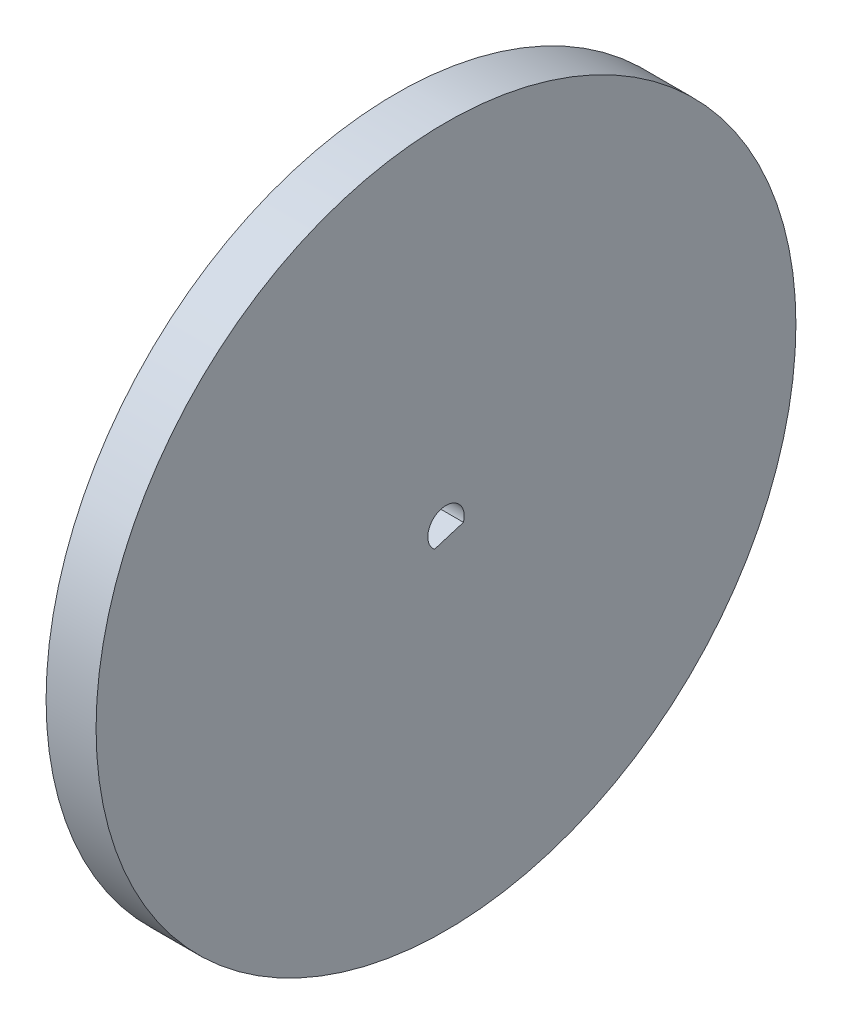
ISO-10303-21;
HEADER;
FILE_DESCRIPTION(('STEP AP214'),'2;1');
FILE_NAME('part.step','',(''),(''),'','','');
FILE_SCHEMA(('AUTOMOTIVE_DESIGN { 1 0 10303 214 1 1 1 1 }'));
ENDSEC;
DATA;
#1=APPLICATION_CONTEXT('core data for automotive mechanical design processes');
#2=APPLICATION_PROTOCOL_DEFINITION('international standard','automotive_design',2000,#1);
#3=PRODUCT_CONTEXT('',#1,'mechanical');
#4=PRODUCT('Part','Part','',(#3));
#5=PRODUCT_RELATED_PRODUCT_CATEGORY('part','',(#4));
#6=PRODUCT_DEFINITION_FORMATION('','',#4);
#7=PRODUCT_DEFINITION_CONTEXT('part definition',#1,'design');
#8=PRODUCT_DEFINITION('design','',#6,#7);
#9=PRODUCT_DEFINITION_SHAPE('','',#8);
#10=(LENGTH_UNIT() NAMED_UNIT(*) SI_UNIT(.MILLI.,.METRE.));
#11=(NAMED_UNIT(*) PLANE_ANGLE_UNIT() SI_UNIT($,.RADIAN.));
#12=(NAMED_UNIT(*) SI_UNIT($,.STERADIAN.) SOLID_ANGLE_UNIT());
#13=UNCERTAINTY_MEASURE_WITH_UNIT(LENGTH_MEASURE(1.E-05),#10,'distance_accuracy_value','');
#14=(GEOMETRIC_REPRESENTATION_CONTEXT(3) GLOBAL_UNCERTAINTY_ASSIGNED_CONTEXT((#13)) GLOBAL_UNIT_ASSIGNED_CONTEXT((#10,
#11,#12)) REPRESENTATION_CONTEXT('',''));
#15=CARTESIAN_POINT('',(0.,0.,0.));
#16=DIRECTION('',(0.,0.,1.));
#17=DIRECTION('',(1.,0.,0.));
#18=AXIS2_PLACEMENT_3D('',#15,#16,#17);
#19=CARTESIAN_POINT('',(6.35,0.,0.));
#20=DIRECTION('',(-1.,0.,0.));
#21=DIRECTION('',(0.,0.,1.));
#22=AXIS2_PLACEMENT_3D('',#19,#20,#21);
#23=CYLINDRICAL_SURFACE('',#22,44.45);
#24=CARTESIAN_POINT('',(6.35,0.,0.));
#25=DIRECTION('',(1.,0.,0.));
#26=DIRECTION('',(0.,0.,-1.));
#27=AXIS2_PLACEMENT_3D('',#24,#25,#26);
#28=CIRCLE('',#27,44.45);
#29=CARTESIAN_POINT('',(6.35,0.,-44.45));
#30=VERTEX_POINT('',#29);
#31=EDGE_CURVE('E11',#30,#30,#28,.T.);
#32=ORIENTED_EDGE('',*,*,#31,.F.);
#33=EDGE_LOOP('',(#32));
#34=FACE_BOUND('',#33,.T.);
#35=CARTESIAN_POINT('',(0.,0.,0.));
#36=DIRECTION('',(1.,0.,0.));
#37=DIRECTION('',(0.,0.,-1.));
#38=AXIS2_PLACEMENT_3D('',#35,#36,#37);
#39=CIRCLE('',#38,44.45);
#40=CARTESIAN_POINT('',(0.,0.,-44.45));
#41=VERTEX_POINT('',#40);
#42=EDGE_CURVE('E40',#41,#41,#39,.T.);
#43=ORIENTED_EDGE('',*,*,#42,.T.);
#44=EDGE_LOOP('',(#43));
#45=FACE_BOUND('',#44,.T.);
#46=ADVANCED_FACE('F37',(#34,#45),#23,.T.);
#47=CARTESIAN_POINT('',(6.35,0.,0.));
#48=DIRECTION('',(1.,0.,0.));
#49=DIRECTION('',(0.,0.,-1.));
#50=AXIS2_PLACEMENT_3D('',#47,#48,#49);
#51=PLANE('',#50);
#52=CARTESIAN_POINT('',(6.35,0.,0.));
#53=DIRECTION('',(1.,0.,0.));
#54=DIRECTION('',(0.,0.,-1.));
#55=AXIS2_PLACEMENT_3D('',#52,#53,#54);
#56=CIRCLE('',#55,2.3114);
#57=CARTESIAN_POINT('',(6.35,-0.654788653581355,-2.21671418526185));
#58=VERTEX_POINT('',#57);
#59=CARTESIAN_POINT('',(6.35,-1.78591335631097,1.46733889873815));
#60=VERTEX_POINT('',#59);
#61=EDGE_CURVE('E51',#58,#60,#56,.T.);
#62=ORIENTED_EDGE('',*,*,#61,.F.);
#63=DIRECTION('',(0.,0.293509759178708,-0.955956077059431));
#64=VECTOR('',#63,1.);
#65=CARTESIAN_POINT('',(6.35,-1.78591335631097,1.46733889873815));
#66=LINE('',#65,#64);
#67=EDGE_CURVE('E70',#60,#58,#66,.T.);
#68=ORIENTED_EDGE('',*,*,#67,.F.);
#69=EDGE_LOOP('',(#62,#68));
#70=FACE_BOUND('',#69,.T.);
#71=ORIENTED_EDGE('',*,*,#31,.T.);
#72=EDGE_LOOP('',(#71));
#73=FACE_BOUND('',#72,.T.);
#74=ADVANCED_FACE('F74',(#70,#73),#51,.T.);
#75=CARTESIAN_POINT('',(0.,0.,0.));
#76=DIRECTION('',(1.,0.,0.));
#77=DIRECTION('',(0.,0.,-1.));
#78=AXIS2_PLACEMENT_3D('',#75,#76,#77);
#79=PLANE('',#78);
#80=DIRECTION('',(0.,0.293509759178708,-0.955956077059431));
#81=VECTOR('',#80,1.);
#82=CARTESIAN_POINT('',(0.,-1.78591335631097,1.46733889873815));
#83=LINE('',#82,#81);
#84=CARTESIAN_POINT('',(0.,-1.78591335631097,1.46733889873815));
#85=VERTEX_POINT('',#84);
#86=CARTESIAN_POINT('',(0.,-0.654788653581355,-2.21671418526185));
#87=VERTEX_POINT('',#86);
#88=EDGE_CURVE('E78',#85,#87,#83,.T.);
#89=ORIENTED_EDGE('',*,*,#88,.T.);
#90=CARTESIAN_POINT('',(0.,0.,0.));
#91=DIRECTION('',(1.,0.,0.));
#92=DIRECTION('',(0.,0.,-1.));
#93=AXIS2_PLACEMENT_3D('',#90,#91,#92);
#94=CIRCLE('',#93,2.3114);
#95=EDGE_CURVE('E56',#87,#85,#94,.T.);
#96=ORIENTED_EDGE('',*,*,#95,.T.);
#97=EDGE_LOOP('',(#89,#96));
#98=FACE_BOUND('',#97,.T.);
#99=ORIENTED_EDGE('',*,*,#42,.F.);
#100=EDGE_LOOP('',(#99));
#101=FACE_BOUND('',#100,.T.);
#102=ADVANCED_FACE('F82',(#98,#101),#79,.F.);
#103=CARTESIAN_POINT('',(0.,0.,0.));
#104=DIRECTION('',(1.,0.,0.));
#105=DIRECTION('',(0.,0.,-1.));
#106=AXIS2_PLACEMENT_3D('',#103,#104,#105);
#107=CYLINDRICAL_SURFACE('',#106,2.3114);
#108=ORIENTED_EDGE('',*,*,#61,.T.);
#109=DIRECTION('',(1.,0.,0.));
#110=VECTOR('',#109,1.);
#111=CARTESIAN_POINT('',(0.,-1.78591335631097,1.46733889873815));
#112=LINE('',#111,#110);
#113=EDGE_CURVE('E67',#85,#60,#112,.T.);
#114=ORIENTED_EDGE('',*,*,#113,.F.);
#115=ORIENTED_EDGE('',*,*,#95,.F.);
#116=DIRECTION('',(1.,0.,0.));
#117=VECTOR('',#116,1.);
#118=CARTESIAN_POINT('',(0.,-0.654788653581355,-2.21671418526185));
#119=LINE('',#118,#117);
#120=EDGE_CURVE('E61',#87,#58,#119,.T.);
#121=ORIENTED_EDGE('',*,*,#120,.T.);
#122=EDGE_LOOP('',(#108,#114,#115,#121));
#123=FACE_BOUND('',#122,.T.);
#124=ADVANCED_FACE('F63',(#123),#107,.F.);
#125=CARTESIAN_POINT('',(0.,-1.78591335631097,1.46733889873815));
#126=DIRECTION('',(0.,-0.955956077059431,-0.293509759178708));
#127=DIRECTION('',(0.,0.293509759178708,-0.955956077059431));
#128=AXIS2_PLACEMENT_3D('',#125,#126,#127);
#129=PLANE('',#128);
#130=ORIENTED_EDGE('',*,*,#67,.T.);
#131=ORIENTED_EDGE('',*,*,#120,.F.);
#132=ORIENTED_EDGE('',*,*,#88,.F.);
#133=ORIENTED_EDGE('',*,*,#113,.T.);
#134=EDGE_LOOP('',(#130,#131,#132,#133));
#135=FACE_BOUND('',#134,.T.);
#136=ADVANCED_FACE('F71',(#135),#129,.F.);
#137=CLOSED_SHELL('',(#46,#74,#102,#124,#136));
#138=MANIFOLD_SOLID_BREP('B2',#137);
#139=ADVANCED_BREP_SHAPE_REPRESENTATION('',(#18,#138),#14);
#140=SHAPE_DEFINITION_REPRESENTATION(#9,#139);
ENDSEC;
END-ISO-10303-21;
